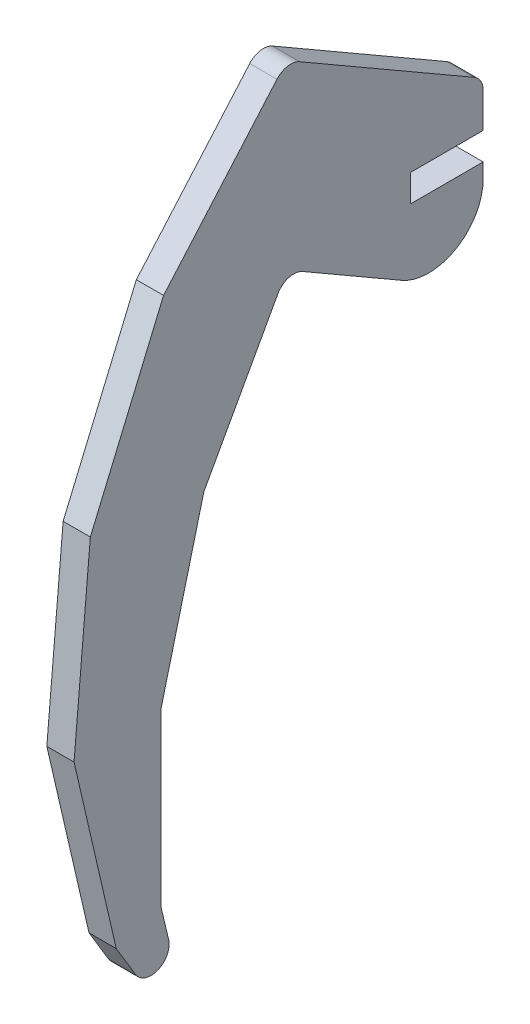
ISO-10303-21;
HEADER;
FILE_DESCRIPTION(('STEP AP214'),'2;1');
FILE_NAME('part.step','',(''),(''),'','','');
FILE_SCHEMA(('AUTOMOTIVE_DESIGN { 1 0 10303 214 1 1 1 1 }'));
ENDSEC;
DATA;
#1=APPLICATION_CONTEXT('core data for automotive mechanical design processes');
#2=APPLICATION_PROTOCOL_DEFINITION('international standard','automotive_design',2000,#1);
#3=PRODUCT_CONTEXT('',#1,'mechanical');
#4=PRODUCT('Part','Part','',(#3));
#5=PRODUCT_RELATED_PRODUCT_CATEGORY('part','',(#4));
#6=PRODUCT_DEFINITION_FORMATION('','',#4);
#7=PRODUCT_DEFINITION_CONTEXT('part definition',#1,'design');
#8=PRODUCT_DEFINITION('design','',#6,#7);
#9=PRODUCT_DEFINITION_SHAPE('','',#8);
#10=(LENGTH_UNIT() NAMED_UNIT(*) SI_UNIT(.MILLI.,.METRE.));
#11=(NAMED_UNIT(*) PLANE_ANGLE_UNIT() SI_UNIT($,.RADIAN.));
#12=(NAMED_UNIT(*) SI_UNIT($,.STERADIAN.) SOLID_ANGLE_UNIT());
#13=UNCERTAINTY_MEASURE_WITH_UNIT(LENGTH_MEASURE(1.E-05),#10,'distance_accuracy_value','');
#14=(GEOMETRIC_REPRESENTATION_CONTEXT(3) GLOBAL_UNCERTAINTY_ASSIGNED_CONTEXT((#13)) GLOBAL_UNIT_ASSIGNED_CONTEXT((#10,
#11,#12)) REPRESENTATION_CONTEXT('',''));
#15=CARTESIAN_POINT('',(0.,0.,0.));
#16=DIRECTION('',(0.,0.,1.));
#17=DIRECTION('',(1.,0.,0.));
#18=AXIS2_PLACEMENT_3D('',#15,#16,#17);
#19=CARTESIAN_POINT('',(3.,2.49999999999475,-21.6506350946111));
#20=DIRECTION('',(0.,1.,0.));
#21=DIRECTION('',(0.,0.,1.));
#22=AXIS2_PLACEMENT_3D('',#19,#20,#21);
#23=PLANE('',#22);
#24=DIRECTION('',(0.,0.,-1.));
#25=VECTOR('',#24,1.);
#26=CARTESIAN_POINT('',(0.,2.49999999999475,-21.6506350946111));
#27=LINE('',#26,#25);
#28=CARTESIAN_POINT('',(0.,2.49999999999475,-13.6506350946111));
#29=VERTEX_POINT('',#28);
#30=CARTESIAN_POINT('',(0.,2.49999999999475,-21.6506350946111));
#31=VERTEX_POINT('',#30);
#32=EDGE_CURVE('E207',#29,#31,#27,.T.);
#33=ORIENTED_EDGE('',*,*,#32,.T.);
#34=DIRECTION('',(-1.,0.,0.));
#35=VECTOR('',#34,1.);
#36=CARTESIAN_POINT('',(3.,2.49999999999475,-21.6506350946111));
#37=LINE('',#36,#35);
#38=CARTESIAN_POINT('',(3.,2.49999999999475,-21.6506350946111));
#39=VERTEX_POINT('',#38);
#40=EDGE_CURVE('E11',#39,#31,#37,.T.);
#41=ORIENTED_EDGE('',*,*,#40,.F.);
#42=DIRECTION('',(0.,0.,-1.));
#43=VECTOR('',#42,1.);
#44=CARTESIAN_POINT('',(3.,2.49999999999475,-21.6506350946111));
#45=LINE('',#44,#43);
#46=CARTESIAN_POINT('',(3.,2.49999999999475,-13.6506350946111));
#47=VERTEX_POINT('',#46);
#48=EDGE_CURVE('E247',#47,#39,#45,.T.);
#49=ORIENTED_EDGE('',*,*,#48,.F.);
#50=DIRECTION('',(-1.,0.,0.));
#51=VECTOR('',#50,1.);
#52=CARTESIAN_POINT('',(3.,2.49999999999475,-13.6506350946111));
#53=LINE('',#52,#51);
#54=EDGE_CURVE('E203',#47,#29,#53,.T.);
#55=ORIENTED_EDGE('',*,*,#54,.T.);
#56=EDGE_LOOP('',(#33,#41,#49,#55));
#57=FACE_BOUND('',#56,.T.);
#58=ADVANCED_FACE('F33',(#57),#23,.F.);
#59=CARTESIAN_POINT('',(3.,6.34529946161551,-21.650635094611));
#60=DIRECTION('',(0.,0.,1.));
#61=DIRECTION('',(0.,-1.,0.));
#62=AXIS2_PLACEMENT_3D('',#59,#60,#61);
#63=PLANE('',#62);
#64=DIRECTION('',(0.,1.,0.));
#65=VECTOR('',#64,1.);
#66=CARTESIAN_POINT('',(0.,6.34529946161551,-21.650635094611));
#67=LINE('',#66,#65);
#68=CARTESIAN_POINT('',(0.,6.34529946161551,-21.650635094611));
#69=VERTEX_POINT('',#68);
#70=EDGE_CURVE('E210',#31,#69,#67,.T.);
#71=ORIENTED_EDGE('',*,*,#70,.T.);
#72=DIRECTION('',(-1.,0.,0.));
#73=VECTOR('',#72,1.);
#74=CARTESIAN_POINT('',(3.,6.34529946161551,-21.650635094611));
#75=LINE('',#74,#73);
#76=CARTESIAN_POINT('',(3.,6.34529946161551,-21.650635094611));
#77=VERTEX_POINT('',#76);
#78=EDGE_CURVE('E41',#77,#69,#75,.T.);
#79=ORIENTED_EDGE('',*,*,#78,.F.);
#80=DIRECTION('',(0.,1.,0.));
#81=VECTOR('',#80,1.);
#82=CARTESIAN_POINT('',(3.,6.34529946161551,-21.650635094611));
#83=LINE('',#82,#81);
#84=EDGE_CURVE('E131',#39,#77,#83,.T.);
#85=ORIENTED_EDGE('',*,*,#84,.F.);
#86=ORIENTED_EDGE('',*,*,#40,.T.);
#87=EDGE_LOOP('',(#71,#79,#85,#86));
#88=FACE_BOUND('',#87,.T.);
#89=ADVANCED_FACE('F370',(#88),#63,.F.);
#90=CARTESIAN_POINT('',(3.,6.34529946161549,-19.650635094611));
#91=DIRECTION('',(-1.,0.,0.));
#92=DIRECTION('',(0.,0.,1.));
#93=AXIS2_PLACEMENT_3D('',#90,#91,#92);
#94=CYLINDRICAL_SURFACE('',#93,2.00000000000001);
#95=CARTESIAN_POINT('',(0.,6.34529946161549,-19.650635094611));
#96=DIRECTION('',(1.,0.,0.));
#97=DIRECTION('',(0.,0.,1.));
#98=AXIS2_PLACEMENT_3D('',#95,#96,#97);
#99=CIRCLE('',#98,2.00000000000001);
#100=CARTESIAN_POINT('',(0.,8.07735026918437,-20.650635094611));
#101=VERTEX_POINT('',#100);
#102=EDGE_CURVE('E212',#69,#101,#99,.T.);
#103=ORIENTED_EDGE('',*,*,#102,.T.);
#104=DIRECTION('',(-1.,0.,0.));
#105=VECTOR('',#104,1.);
#106=CARTESIAN_POINT('',(3.,8.07735026918437,-20.650635094611));
#107=LINE('',#106,#105);
#108=CARTESIAN_POINT('',(3.,8.07735026918437,-20.650635094611));
#109=VERTEX_POINT('',#108);
#110=EDGE_CURVE('E293',#109,#101,#107,.T.);
#111=ORIENTED_EDGE('',*,*,#110,.F.);
#112=CARTESIAN_POINT('',(3.,6.34529946161549,-19.650635094611));
#113=DIRECTION('',(1.,0.,0.));
#114=DIRECTION('',(0.,0.,1.));
#115=AXIS2_PLACEMENT_3D('',#112,#113,#114);
#116=CIRCLE('',#115,2.00000000000001);
#117=EDGE_CURVE('E301',#77,#109,#116,.T.);
#118=ORIENTED_EDGE('',*,*,#117,.F.);
#119=ORIENTED_EDGE('',*,*,#78,.T.);
#120=EDGE_LOOP('',(#103,#111,#118,#119));
#121=FACE_BOUND('',#120,.T.);
#122=ADVANCED_FACE('F299',(#121),#94,.T.);
#123=CARTESIAN_POINT('',(3.,19.175465981255,-1.42813481302609));
#124=DIRECTION('',(0.,-0.86602540378444,0.499999999999998));
#125=DIRECTION('',(0.,-0.499999999999998,-0.86602540378444));
#126=AXIS2_PLACEMENT_3D('',#123,#124,#125);
#127=PLANE('',#126);
#128=DIRECTION('',(0.,0.499999999999998,0.86602540378444));
#129=VECTOR('',#128,1.);
#130=CARTESIAN_POINT('',(0.,19.175465981255,-1.42813481302609));
#131=LINE('',#130,#129);
#132=CARTESIAN_POINT('',(0.,19.175465981255,-1.42813481302609));
#133=VERTEX_POINT('',#132);
#134=EDGE_CURVE('E214',#101,#133,#131,.T.);
#135=ORIENTED_EDGE('',*,*,#134,.T.);
#136=DIRECTION('',(-1.,0.,0.));
#137=VECTOR('',#136,1.);
#138=CARTESIAN_POINT('',(3.,19.175465981255,-1.42813481302609));
#139=LINE('',#138,#137);
#140=CARTESIAN_POINT('',(3.,19.175465981255,-1.42813481302609));
#141=VERTEX_POINT('',#140);
#142=EDGE_CURVE('E290',#141,#133,#139,.T.);
#143=ORIENTED_EDGE('',*,*,#142,.F.);
#144=DIRECTION('',(0.,0.499999999999998,0.86602540378444));
#145=VECTOR('',#144,1.);
#146=CARTESIAN_POINT('',(3.,19.175465981255,-1.42813481302609));
#147=LINE('',#146,#145);
#148=EDGE_CURVE('E319',#109,#141,#147,.T.);
#149=ORIENTED_EDGE('',*,*,#148,.F.);
#150=ORIENTED_EDGE('',*,*,#110,.T.);
#151=EDGE_LOOP('',(#135,#143,#149,#150));
#152=FACE_BOUND('',#151,.T.);
#153=ADVANCED_FACE('F310',(#152),#127,.F.);
#154=CARTESIAN_POINT('',(3.,17.4434151736861,-0.428134813026099));
#155=DIRECTION('',(-1.,0.,0.));
#156=DIRECTION('',(0.,0.,1.));
#157=AXIS2_PLACEMENT_3D('',#154,#155,#156);
#158=CYLINDRICAL_SURFACE('',#157,2.);
#159=CARTESIAN_POINT('',(0.,17.4434151736861,-0.428134813026099));
#160=DIRECTION('',(1.,0.,0.));
#161=DIRECTION('',(0.,0.,-1.));
#162=AXIS2_PLACEMENT_3D('',#159,#160,#161);
#163=CIRCLE('',#162,2.);
#164=CARTESIAN_POINT('',(0.,18.7551779984705,1.08159307355275));
#165=VERTEX_POINT('',#164);
#166=EDGE_CURVE('E216',#133,#165,#163,.T.);
#167=ORIENTED_EDGE('',*,*,#166,.T.);
#168=DIRECTION('',(-1.,0.,0.));
#169=VECTOR('',#168,1.);
#170=CARTESIAN_POINT('',(3.,18.7551779984705,1.08159307355275));
#171=LINE('',#170,#169);
#172=CARTESIAN_POINT('',(3.,18.7551779984705,1.08159307355275));
#173=VERTEX_POINT('',#172);
#174=EDGE_CURVE('E287',#173,#165,#171,.T.);
#175=ORIENTED_EDGE('',*,*,#174,.F.);
#176=CARTESIAN_POINT('',(3.,17.4434151736861,-0.428134813026099));
#177=DIRECTION('',(1.,0.,0.));
#178=DIRECTION('',(0.,0.,-1.));
#179=AXIS2_PLACEMENT_3D('',#176,#177,#178);
#180=CIRCLE('',#179,2.);
#181=EDGE_CURVE('E316',#141,#173,#180,.T.);
#182=ORIENTED_EDGE('',*,*,#181,.F.);
#183=ORIENTED_EDGE('',*,*,#142,.T.);
#184=EDGE_LOOP('',(#167,#175,#182,#183));
#185=FACE_BOUND('',#184,.T.);
#186=ADVANCED_FACE('F314',(#185),#158,.T.);
#187=CARTESIAN_POINT('',(3.,18.7551779984705,1.08159307355275));
#188=DIRECTION('',(0.,-0.655881412392163,-0.754863943289425));
#189=DIRECTION('',(0.,0.754863943289426,-0.655881412392163));
#190=AXIS2_PLACEMENT_3D('',#187,#188,#189);
#191=PLANE('',#190);
#192=DIRECTION('',(0.,-0.754863943289425,0.655881412392163));
#193=VECTOR('',#192,1.);
#194=CARTESIAN_POINT('',(0.,18.7551779984705,1.08159307355275));
#195=LINE('',#194,#193);
#196=CARTESIAN_POINT('',(0.,4.37047332924356,13.5800843568744));
#197=VERTEX_POINT('',#196);
#198=EDGE_CURVE('E218',#165,#197,#195,.T.);
#199=ORIENTED_EDGE('',*,*,#198,.T.);
#200=DIRECTION('',(-1.,0.,0.));
#201=VECTOR('',#200,1.);
#202=CARTESIAN_POINT('',(3.,4.37047332924356,13.5800843568744));
#203=LINE('',#202,#201);
#204=CARTESIAN_POINT('',(3.,4.37047332924356,13.5800843568744));
#205=VERTEX_POINT('',#204);
#206=EDGE_CURVE('E284',#205,#197,#203,.T.);
#207=ORIENTED_EDGE('',*,*,#206,.F.);
#208=DIRECTION('',(0.,-0.754863943289425,0.655881412392163));
#209=VECTOR('',#208,1.);
#210=CARTESIAN_POINT('',(3.,18.7551779984705,1.08159307355275));
#211=LINE('',#210,#209);
#212=EDGE_CURVE('E318',#173,#205,#211,.T.);
#213=ORIENTED_EDGE('',*,*,#212,.F.);
#214=ORIENTED_EDGE('',*,*,#174,.T.);
#215=EDGE_LOOP('',(#199,#207,#213,#214));
#216=FACE_BOUND('',#215,.T.);
#217=ADVANCED_FACE('F383',(#216),#191,.F.);
#218=CARTESIAN_POINT('',(3.,4.37047332924356,13.5800843568744));
#219=DIRECTION('',(0.,-0.390514504255119,-0.920596774905484));
#220=DIRECTION('',(0.,0.920596774905484,-0.390514504255119));
#221=AXIS2_PLACEMENT_3D('',#218,#219,#220);
#222=PLANE('',#221);
#223=DIRECTION('',(0.,-0.920596774905484,0.390514504255119));
#224=VECTOR('',#223,1.);
#225=CARTESIAN_POINT('',(0.,4.37047332924356,13.5800843568744));
#226=LINE('',#225,#224);
#227=CARTESIAN_POINT('',(0.,-14.6534289365135,21.6499689847808));
#228=VERTEX_POINT('',#227);
#229=EDGE_CURVE('E220',#197,#228,#226,.T.);
#230=ORIENTED_EDGE('',*,*,#229,.T.);
#231=DIRECTION('',(-1.,0.,0.));
#232=VECTOR('',#231,1.);
#233=CARTESIAN_POINT('',(3.,-14.6534289365135,21.6499689847808));
#234=LINE('',#233,#232);
#235=CARTESIAN_POINT('',(3.,-14.6534289365135,21.6499689847808));
#236=VERTEX_POINT('',#235);
#237=EDGE_CURVE('E281',#236,#228,#234,.T.);
#238=ORIENTED_EDGE('',*,*,#237,.F.);
#239=DIRECTION('',(0.,-0.920596774905484,0.390514504255119));
#240=VECTOR('',#239,1.);
#241=CARTESIAN_POINT('',(3.,4.37047332924356,13.5800843568744));
#242=LINE('',#241,#240);
#243=EDGE_CURVE('E321',#205,#236,#242,.T.);
#244=ORIENTED_EDGE('',*,*,#243,.F.);
#245=ORIENTED_EDGE('',*,*,#206,.T.);
#246=EDGE_LOOP('',(#230,#238,#244,#245));
#247=FACE_BOUND('',#246,.T.);
#248=ADVANCED_FACE('F386',(#247),#222,.F.);
#249=CARTESIAN_POINT('',(3.,-14.6534289365135,21.6499689847808));
#250=DIRECTION('',(0.,-0.0869213155670386,-0.996215180018903));
#251=DIRECTION('',(0.,0.996215180018903,-0.0869213155670386));
#252=AXIS2_PLACEMENT_3D('',#249,#250,#251);
#253=PLANE('',#252);
#254=DIRECTION('',(0.,-0.996215180018903,0.0869213155670386));
#255=VECTOR('',#254,1.);
#256=CARTESIAN_POINT('',(0.,-14.6534289365135,21.6499689847808));
#257=LINE('',#256,#255);
#258=CARTESIAN_POINT('',(0.,-35.239966644392,23.4461762464542));
#259=VERTEX_POINT('',#258);
#260=EDGE_CURVE('E222',#228,#259,#257,.T.);
#261=ORIENTED_EDGE('',*,*,#260,.T.);
#262=DIRECTION('',(-1.,0.,0.));
#263=VECTOR('',#262,1.);
#264=CARTESIAN_POINT('',(3.,-35.239966644392,23.4461762464542));
#265=LINE('',#264,#263);
#266=CARTESIAN_POINT('',(3.,-35.239966644392,23.4461762464542));
#267=VERTEX_POINT('',#266);
#268=EDGE_CURVE('E278',#267,#259,#265,.T.);
#269=ORIENTED_EDGE('',*,*,#268,.F.);
#270=DIRECTION('',(0.,-0.996215180018903,0.0869213155670386));
#271=VECTOR('',#270,1.);
#272=CARTESIAN_POINT('',(3.,-14.6534289365135,21.6499689847808));
#273=LINE('',#272,#271);
#274=EDGE_CURVE('E327',#236,#267,#273,.T.);
#275=ORIENTED_EDGE('',*,*,#274,.F.);
#276=ORIENTED_EDGE('',*,*,#237,.T.);
#277=EDGE_LOOP('',(#261,#269,#275,#276));
#278=FACE_BOUND('',#277,.T.);
#279=ADVANCED_FACE('F390',(#278),#253,.F.);
#280=CARTESIAN_POINT('',(3.,-35.239966644392,23.4461762464542));
#281=DIRECTION('',(0.,0.225180337105159,-0.97431710227277));
#282=DIRECTION('',(0.,0.97431710227277,0.225180337105159));
#283=AXIS2_PLACEMENT_3D('',#280,#281,#282);
#284=PLANE('',#283);
#285=DIRECTION('',(0.,-0.97431710227277,-0.225180337105159));
#286=VECTOR('',#285,1.);
#287=CARTESIAN_POINT('',(0.,-35.239966644392,23.4461762464542));
#288=LINE('',#287,#286);
#289=CARTESIAN_POINT('',(0.,-55.3739860487026,18.7928808602102));
#290=VERTEX_POINT('',#289);
#291=EDGE_CURVE('E224',#259,#290,#288,.T.);
#292=ORIENTED_EDGE('',*,*,#291,.T.);
#293=DIRECTION('',(-1.,0.,0.));
#294=VECTOR('',#293,1.);
#295=CARTESIAN_POINT('',(3.,-55.3739860487026,18.7928808602102));
#296=LINE('',#295,#294);
#297=CARTESIAN_POINT('',(3.,-55.3739860487026,18.7928808602102));
#298=VERTEX_POINT('',#297);
#299=EDGE_CURVE('E275',#298,#290,#296,.T.);
#300=ORIENTED_EDGE('',*,*,#299,.F.);
#301=DIRECTION('',(0.,-0.97431710227277,-0.225180337105159));
#302=VECTOR('',#301,1.);
#303=CARTESIAN_POINT('',(3.,-35.239966644392,23.4461762464542));
#304=LINE('',#303,#302);
#305=EDGE_CURVE('E329',#267,#298,#304,.T.);
#306=ORIENTED_EDGE('',*,*,#305,.F.);
#307=ORIENTED_EDGE('',*,*,#268,.T.);
#308=EDGE_LOOP('',(#292,#300,#306,#307));
#309=FACE_BOUND('',#308,.T.);
#310=ADVANCED_FACE('F394',(#309),#284,.F.);
#311=CARTESIAN_POINT('',(3.,-55.3739860487026,18.7928808602102));
#312=DIRECTION('',(0.,0.515239769457841,-0.857046078089755));
#313=DIRECTION('',(0.,0.857046078089755,0.515239769457841));
#314=AXIS2_PLACEMENT_3D('',#311,#312,#313);
#315=PLANE('',#314);
#316=DIRECTION('',(0.,-0.857046078089755,-0.515239769457841));
#317=VECTOR('',#316,1.);
#318=CARTESIAN_POINT('',(0.,-55.3739860487026,18.7928808602102));
#319=LINE('',#318,#317);
#320=CARTESIAN_POINT('',(0.,-58.8914677061583,16.6782379202423));
#321=VERTEX_POINT('',#320);
#322=EDGE_CURVE('E226',#290,#321,#319,.T.);
#323=ORIENTED_EDGE('',*,*,#322,.T.);
#324=DIRECTION('',(-1.,0.,0.));
#325=VECTOR('',#324,1.);
#326=CARTESIAN_POINT('',(3.,-58.8914677061583,16.6782379202423));
#327=LINE('',#326,#325);
#328=CARTESIAN_POINT('',(3.,-58.8914677061583,16.6782379202423));
#329=VERTEX_POINT('',#328);
#330=EDGE_CURVE('E272',#329,#321,#327,.T.);
#331=ORIENTED_EDGE('',*,*,#330,.F.);
#332=DIRECTION('',(0.,-0.857046078089755,-0.515239769457841));
#333=VECTOR('',#332,1.);
#334=CARTESIAN_POINT('',(3.,-55.3739860487026,18.7928808602102));
#335=LINE('',#334,#333);
#336=EDGE_CURVE('E331',#298,#329,#335,.T.);
#337=ORIENTED_EDGE('',*,*,#336,.F.);
#338=ORIENTED_EDGE('',*,*,#299,.T.);
#339=EDGE_LOOP('',(#323,#331,#337,#338));
#340=FACE_BOUND('',#339,.T.);
#341=ADVANCED_FACE('F398',(#340),#315,.F.);
#342=CARTESIAN_POINT('',(3.,-57.8609881672429,14.9641457640626));
#343=DIRECTION('',(-1.,0.,0.));
#344=DIRECTION('',(0.,0.,1.));
#345=AXIS2_PLACEMENT_3D('',#342,#343,#344);
#346=CYLINDRICAL_SURFACE('',#345,2.);
#347=CARTESIAN_POINT('',(0.,-57.8609881672429,14.9641457640626));
#348=DIRECTION('',(1.,0.,0.));
#349=DIRECTION('',(0.,0.,1.));
#350=AXIS2_PLACEMENT_3D('',#347,#348,#349);
#351=CIRCLE('',#350,2.);
#352=CARTESIAN_POINT('',(0.,-57.3951192414375,13.0191608942066));
#353=VERTEX_POINT('',#352);
#354=EDGE_CURVE('E228',#321,#353,#351,.T.);
#355=ORIENTED_EDGE('',*,*,#354,.T.);
#356=DIRECTION('',(-1.,0.,0.));
#357=VECTOR('',#356,1.);
#358=CARTESIAN_POINT('',(3.,-57.3951192414375,13.0191608942066));
#359=LINE('',#358,#357);
#360=CARTESIAN_POINT('',(3.,-57.3951192414375,13.0191608942066));
#361=VERTEX_POINT('',#360);
#362=EDGE_CURVE('E269',#361,#353,#359,.T.);
#363=ORIENTED_EDGE('',*,*,#362,.F.);
#364=CARTESIAN_POINT('',(3.,-57.8609881672429,14.9641457640626));
#365=DIRECTION('',(1.,0.,0.));
#366=DIRECTION('',(0.,0.,1.));
#367=AXIS2_PLACEMENT_3D('',#364,#365,#366);
#368=CIRCLE('',#367,2.);
#369=EDGE_CURVE('E333',#329,#361,#368,.T.);
#370=ORIENTED_EDGE('',*,*,#369,.F.);
#371=ORIENTED_EDGE('',*,*,#330,.T.);
#372=EDGE_LOOP('',(#355,#363,#370,#371));
#373=FACE_BOUND('',#372,.T.);
#374=ADVANCED_FACE('F402',(#373),#346,.T.);
#375=CARTESIAN_POINT('',(3.,-53.8468848788973,13.8690452077559));
#376=DIRECTION('',(0.,-0.232934462902559,0.972492434928055));
#377=DIRECTION('',(0.,-0.972492434928055,-0.232934462902559));
#378=AXIS2_PLACEMENT_3D('',#375,#376,#377);
#379=PLANE('',#378);
#380=DIRECTION('',(0.,0.972492434928055,0.232934462902559));
#381=VECTOR('',#380,1.);
#382=CARTESIAN_POINT('',(0.,-53.8468848788973,13.8690452077559));
#383=LINE('',#382,#381);
#384=CARTESIAN_POINT('',(0.,-53.8468848788973,13.8690452077559));
#385=VERTEX_POINT('',#384);
#386=EDGE_CURVE('E230',#353,#385,#383,.T.);
#387=ORIENTED_EDGE('',*,*,#386,.T.);
#388=DIRECTION('',(-1.,0.,0.));
#389=VECTOR('',#388,1.);
#390=CARTESIAN_POINT('',(3.,-53.8468848788973,13.8690452077559));
#391=LINE('',#390,#389);
#392=CARTESIAN_POINT('',(3.,-53.8468848788973,13.8690452077559));
#393=VERTEX_POINT('',#392);
#394=EDGE_CURVE('E266',#393,#385,#391,.T.);
#395=ORIENTED_EDGE('',*,*,#394,.F.);
#396=DIRECTION('',(0.,0.972492434928055,0.232934462902559));
#397=VECTOR('',#396,1.);
#398=CARTESIAN_POINT('',(3.,-53.8468848788973,13.8690452077559));
#399=LINE('',#398,#397);
#400=EDGE_CURVE('E335',#361,#393,#399,.T.);
#401=ORIENTED_EDGE('',*,*,#400,.F.);
#402=ORIENTED_EDGE('',*,*,#362,.T.);
#403=EDGE_LOOP('',(#387,#395,#401,#402));
#404=FACE_BOUND('',#403,.T.);
#405=ADVANCED_FACE('F406',(#404),#379,.F.);
#406=CARTESIAN_POINT('',(3.,-34.9156187672801,13.8546953481199));
#407=DIRECTION('',(0.,0.000757997665291717,0.999999712719729));
#408=DIRECTION('',(0.,-0.999999712719729,0.000757997665291717));
#409=AXIS2_PLACEMENT_3D('',#406,#407,#408);
#410=PLANE('',#409);
#411=DIRECTION('',(0.,0.999999712719728,-0.000757997665291717));
#412=VECTOR('',#411,1.);
#413=CARTESIAN_POINT('',(0.,-34.9156187672801,13.8546953481199));
#414=LINE('',#413,#412);
#415=CARTESIAN_POINT('',(0.,-34.9156187672801,13.8546953481199));
#416=VERTEX_POINT('',#415);
#417=EDGE_CURVE('E232',#385,#416,#414,.T.);
#418=ORIENTED_EDGE('',*,*,#417,.T.);
#419=DIRECTION('',(-1.,0.,0.));
#420=VECTOR('',#419,1.);
#421=CARTESIAN_POINT('',(3.,-34.9156187672801,13.8546953481199));
#422=LINE('',#421,#420);
#423=CARTESIAN_POINT('',(3.,-34.9156187672801,13.8546953481199));
#424=VERTEX_POINT('',#423);
#425=EDGE_CURVE('E263',#424,#416,#422,.T.);
#426=ORIENTED_EDGE('',*,*,#425,.F.);
#427=DIRECTION('',(0.,0.999999712719728,-0.000757997665291717));
#428=VECTOR('',#427,1.);
#429=CARTESIAN_POINT('',(3.,-34.9156187672801,13.8546953481199));
#430=LINE('',#429,#428);
#431=EDGE_CURVE('E337',#393,#424,#430,.T.);
#432=ORIENTED_EDGE('',*,*,#431,.F.);
#433=ORIENTED_EDGE('',*,*,#394,.T.);
#434=EDGE_LOOP('',(#418,#426,#432,#433));
#435=FACE_BOUND('',#434,.T.);
#436=ADVANCED_FACE('F410',(#435),#410,.F.);
#437=CARTESIAN_POINT('',(3.,-16.582681857696,9.13278188252581));
#438=DIRECTION('',(0.,0.249423999495933,0.968394376519945));
#439=DIRECTION('',(0.,-0.968394376519945,0.249423999495933));
#440=AXIS2_PLACEMENT_3D('',#437,#438,#439);
#441=PLANE('',#440);
#442=DIRECTION('',(0.,0.968394376519945,-0.249423999495933));
#443=VECTOR('',#442,1.);
#444=CARTESIAN_POINT('',(0.,-16.582681857696,9.13278188252581));
#445=LINE('',#444,#443);
#446=CARTESIAN_POINT('',(0.,-16.582681857696,9.13278188252581));
#447=VERTEX_POINT('',#446);
#448=EDGE_CURVE('E234',#416,#447,#445,.T.);
#449=ORIENTED_EDGE('',*,*,#448,.T.);
#450=DIRECTION('',(-1.,0.,0.));
#451=VECTOR('',#450,1.);
#452=CARTESIAN_POINT('',(3.,-16.582681857696,9.13278188252581));
#453=LINE('',#452,#451);
#454=CARTESIAN_POINT('',(3.,-16.582681857696,9.13278188252581));
#455=VERTEX_POINT('',#454);
#456=EDGE_CURVE('E260',#455,#447,#453,.T.);
#457=ORIENTED_EDGE('',*,*,#456,.F.);
#458=DIRECTION('',(0.,0.968394376519945,-0.249423999495933));
#459=VECTOR('',#458,1.);
#460=CARTESIAN_POINT('',(3.,-16.582681857696,9.13278188252581));
#461=LINE('',#460,#459);
#462=EDGE_CURVE('E339',#424,#455,#461,.T.);
#463=ORIENTED_EDGE('',*,*,#462,.F.);
#464=ORIENTED_EDGE('',*,*,#425,.T.);
#465=EDGE_LOOP('',(#449,#457,#463,#464));
#466=FACE_BOUND('',#465,.T.);
#467=ADVANCED_FACE('F414',(#466),#441,.F.);
#468=CARTESIAN_POINT('',(3.,-1.78760772575287,0.984510924765902));
#469=DIRECTION('',(0.,0.482417774120942,0.875941260138028));
#470=DIRECTION('',(0.,-0.875941260138028,0.482417774120942));
#471=AXIS2_PLACEMENT_3D('',#468,#469,#470);
#472=PLANE('',#471);
#473=DIRECTION('',(0.,0.875941260138028,-0.482417774120942));
#474=VECTOR('',#473,1.);
#475=CARTESIAN_POINT('',(0.,-1.78760772575287,0.984510924765902));
#476=LINE('',#475,#474);
#477=CARTESIAN_POINT('',(0.,-1.78760772575287,0.984510924765902));
#478=VERTEX_POINT('',#477);
#479=EDGE_CURVE('E236',#447,#478,#476,.T.);
#480=ORIENTED_EDGE('',*,*,#479,.T.);
#481=DIRECTION('',(-1.,0.,0.));
#482=VECTOR('',#481,1.);
#483=CARTESIAN_POINT('',(3.,-1.78760772575287,0.984510924765902));
#484=LINE('',#483,#482);
#485=CARTESIAN_POINT('',(3.,-1.78760772575287,0.984510924765902));
#486=VERTEX_POINT('',#485);
#487=EDGE_CURVE('E257',#486,#478,#484,.T.);
#488=ORIENTED_EDGE('',*,*,#487,.F.);
#489=DIRECTION('',(0.,0.875941260138028,-0.482417774120942));
#490=VECTOR('',#489,1.);
#491=CARTESIAN_POINT('',(3.,-1.78760772575287,0.984510924765902));
#492=LINE('',#491,#490);
#493=EDGE_CURVE('E341',#455,#486,#492,.T.);
#494=ORIENTED_EDGE('',*,*,#493,.F.);
#495=ORIENTED_EDGE('',*,*,#456,.T.);
#496=EDGE_LOOP('',(#480,#488,#494,#495));
#497=FACE_BOUND('',#496,.T.);
#498=ADVANCED_FACE('F418',(#497),#472,.F.);
#499=CARTESIAN_POINT('',(3.,-2.75244327399476,-0.767371595510153));
#500=DIRECTION('',(-1.,0.,0.));
#501=DIRECTION('',(0.,0.,1.));
#502=AXIS2_PLACEMENT_3D('',#499,#500,#501);
#503=CYLINDRICAL_SURFACE('',#502,2.);
#504=CARTESIAN_POINT('',(0.,-2.75244327399476,-0.767371595510153));
#505=DIRECTION('',(-1.,0.,0.));
#506=DIRECTION('',(0.,0.,1.));
#507=AXIS2_PLACEMENT_3D('',#504,#505,#506);
#508=CIRCLE('',#507,2.);
#509=CARTESIAN_POINT('',(0.,-1.02039246642587,-1.76737159551015));
#510=VERTEX_POINT('',#509);
#511=EDGE_CURVE('E238',#478,#510,#508,.T.);
#512=ORIENTED_EDGE('',*,*,#511,.T.);
#513=DIRECTION('',(-1.,0.,0.));
#514=VECTOR('',#513,1.);
#515=CARTESIAN_POINT('',(3.,-1.02039246642587,-1.76737159551015));
#516=LINE('',#515,#514);
#517=CARTESIAN_POINT('',(3.,-1.02039246642587,-1.76737159551015));
#518=VERTEX_POINT('',#517);
#519=EDGE_CURVE('E254',#518,#510,#516,.T.);
#520=ORIENTED_EDGE('',*,*,#519,.F.);
#521=CARTESIAN_POINT('',(3.,-2.75244327399476,-0.767371595510153));
#522=DIRECTION('',(-1.,0.,0.));
#523=DIRECTION('',(0.,0.,1.));
#524=AXIS2_PLACEMENT_3D('',#521,#522,#523);
#525=CIRCLE('',#524,2.);
#526=EDGE_CURVE('E343',#486,#518,#525,.T.);
#527=ORIENTED_EDGE('',*,*,#526,.F.);
#528=ORIENTED_EDGE('',*,*,#487,.T.);
#529=EDGE_LOOP('',(#512,#520,#527,#528));
#530=FACE_BOUND('',#529,.T.);
#531=ADVANCED_FACE('F422',(#530),#503,.F.);
#532=CARTESIAN_POINT('',(3.,-7.30384757729337,-12.650635094611));
#533=DIRECTION('',(0.,0.86602540378444,-0.499999999999998));
#534=DIRECTION('',(0.,0.499999999999998,0.86602540378444));
#535=AXIS2_PLACEMENT_3D('',#532,#533,#534);
#536=PLANE('',#535);
#537=DIRECTION('',(0.,-0.499999999999998,-0.86602540378444));
#538=VECTOR('',#537,1.);
#539=CARTESIAN_POINT('',(0.,-7.30384757729337,-12.650635094611));
#540=LINE('',#539,#538);
#541=CARTESIAN_POINT('',(0.,-7.30384757729337,-12.650635094611));
#542=VERTEX_POINT('',#541);
#543=EDGE_CURVE('E240',#510,#542,#540,.T.);
#544=ORIENTED_EDGE('',*,*,#543,.T.);
#545=DIRECTION('',(-1.,0.,0.));
#546=VECTOR('',#545,1.);
#547=CARTESIAN_POINT('',(3.,-7.30384757729337,-12.650635094611));
#548=LINE('',#547,#546);
#549=CARTESIAN_POINT('',(3.,-7.30384757729337,-12.650635094611));
#550=VERTEX_POINT('',#549);
#551=EDGE_CURVE('E251',#550,#542,#548,.T.);
#552=ORIENTED_EDGE('',*,*,#551,.F.);
#553=DIRECTION('',(0.,-0.499999999999998,-0.86602540378444));
#554=VECTOR('',#553,1.);
#555=CARTESIAN_POINT('',(3.,-7.30384757729337,-12.650635094611));
#556=LINE('',#555,#554);
#557=EDGE_CURVE('E345',#518,#550,#556,.T.);
#558=ORIENTED_EDGE('',*,*,#557,.F.);
#559=ORIENTED_EDGE('',*,*,#519,.T.);
#560=EDGE_LOOP('',(#544,#552,#558,#559));
#561=FACE_BOUND('',#560,.T.);
#562=ADVANCED_FACE('F351',(#561),#536,.F.);
#563=CARTESIAN_POINT('',(3.,-2.10769515458677,-15.6506350946111));
#564=DIRECTION('',(-1.,0.,0.));
#565=DIRECTION('',(0.,0.,1.));
#566=AXIS2_PLACEMENT_3D('',#563,#564,#565);
#567=CYLINDRICAL_SURFACE('',#566,6.);
#568=CARTESIAN_POINT('',(0.,-2.10769515458677,-15.6506350946111));
#569=DIRECTION('',(1.,0.,0.));
#570=DIRECTION('',(0.,0.,1.));
#571=AXIS2_PLACEMENT_3D('',#568,#569,#570);
#572=CIRCLE('',#571,6.);
#573=CARTESIAN_POINT('',(0.,-2.10769515458662,-21.6506350946111));
#574=VERTEX_POINT('',#573);
#575=EDGE_CURVE('E242',#542,#574,#572,.T.);
#576=ORIENTED_EDGE('',*,*,#575,.T.);
#577=DIRECTION('',(-1.,0.,0.));
#578=VECTOR('',#577,1.);
#579=CARTESIAN_POINT('',(3.,-2.10769515458662,-21.6506350946111));
#580=LINE('',#579,#578);
#581=CARTESIAN_POINT('',(3.,-2.10769515458662,-21.6506350946111));
#582=VERTEX_POINT('',#581);
#583=EDGE_CURVE('E198',#582,#574,#580,.T.);
#584=ORIENTED_EDGE('',*,*,#583,.F.);
#585=CARTESIAN_POINT('',(3.,-2.10769515458677,-15.6506350946111));
#586=DIRECTION('',(1.,0.,0.));
#587=DIRECTION('',(0.,0.,1.));
#588=AXIS2_PLACEMENT_3D('',#585,#586,#587);
#589=CIRCLE('',#588,6.);
#590=EDGE_CURVE('E189',#550,#582,#589,.T.);
#591=ORIENTED_EDGE('',*,*,#590,.F.);
#592=ORIENTED_EDGE('',*,*,#551,.T.);
#593=EDGE_LOOP('',(#576,#584,#591,#592));
#594=FACE_BOUND('',#593,.T.);
#595=ADVANCED_FACE('F355',(#594),#567,.T.);
#596=CARTESIAN_POINT('',(3.,-0.500000000005246,-21.6506350946111));
#597=DIRECTION('',(0.,0.,1.));
#598=DIRECTION('',(0.,-1.,0.));
#599=AXIS2_PLACEMENT_3D('',#596,#597,#598);
#600=PLANE('',#599);
#601=DIRECTION('',(0.,1.,0.));
#602=VECTOR('',#601,1.);
#603=CARTESIAN_POINT('',(0.,-0.500000000005246,-21.6506350946111));
#604=LINE('',#603,#602);
#605=CARTESIAN_POINT('',(0.,-0.500000000005246,-21.6506350946111));
#606=VERTEX_POINT('',#605);
#607=EDGE_CURVE('E197',#574,#606,#604,.T.);
#608=ORIENTED_EDGE('',*,*,#607,.T.);
#609=DIRECTION('',(-1.,0.,0.));
#610=VECTOR('',#609,1.);
#611=CARTESIAN_POINT('',(3.,-0.500000000005246,-21.6506350946111));
#612=LINE('',#611,#610);
#613=CARTESIAN_POINT('',(3.,-0.500000000005246,-21.6506350946111));
#614=VERTEX_POINT('',#613);
#615=EDGE_CURVE('E194',#614,#606,#612,.T.);
#616=ORIENTED_EDGE('',*,*,#615,.F.);
#617=DIRECTION('',(0.,1.,0.));
#618=VECTOR('',#617,1.);
#619=CARTESIAN_POINT('',(3.,-0.500000000005246,-21.6506350946111));
#620=LINE('',#619,#618);
#621=EDGE_CURVE('E183',#582,#614,#620,.T.);
#622=ORIENTED_EDGE('',*,*,#621,.F.);
#623=ORIENTED_EDGE('',*,*,#583,.T.);
#624=EDGE_LOOP('',(#608,#616,#622,#623));
#625=FACE_BOUND('',#624,.T.);
#626=ADVANCED_FACE('F195',(#625),#600,.F.);
#627=CARTESIAN_POINT('',(3.,-0.500000000005246,-21.6506350946111));
#628=DIRECTION('',(0.,-1.,0.));
#629=DIRECTION('',(0.,0.,-1.));
#630=AXIS2_PLACEMENT_3D('',#627,#628,#629);
#631=PLANE('',#630);
#632=DIRECTION('',(0.,0.,1.));
#633=VECTOR('',#632,1.);
#634=CARTESIAN_POINT('',(0.,-0.500000000005246,-21.6506350946111));
#635=LINE('',#634,#633);
#636=CARTESIAN_POINT('',(0.,-0.500000000005247,-13.6506350946111));
#637=VERTEX_POINT('',#636);
#638=EDGE_CURVE('E117',#606,#637,#635,.T.);
#639=ORIENTED_EDGE('',*,*,#638,.T.);
#640=DIRECTION('',(-1.,0.,0.));
#641=VECTOR('',#640,1.);
#642=CARTESIAN_POINT('',(3.,-0.500000000005247,-13.6506350946111));
#643=LINE('',#642,#641);
#644=CARTESIAN_POINT('',(3.,-0.500000000005247,-13.6506350946111));
#645=VERTEX_POINT('',#644);
#646=EDGE_CURVE('E199',#645,#637,#643,.T.);
#647=ORIENTED_EDGE('',*,*,#646,.F.);
#648=DIRECTION('',(0.,0.,1.));
#649=VECTOR('',#648,1.);
#650=CARTESIAN_POINT('',(3.,-0.500000000005246,-21.6506350946111));
#651=LINE('',#650,#649);
#652=EDGE_CURVE('E187',#614,#645,#651,.T.);
#653=ORIENTED_EDGE('',*,*,#652,.F.);
#654=ORIENTED_EDGE('',*,*,#615,.T.);
#655=EDGE_LOOP('',(#639,#647,#653,#654));
#656=FACE_BOUND('',#655,.T.);
#657=ADVANCED_FACE('F201',(#656),#631,.F.);
#658=CARTESIAN_POINT('',(3.,2.49999999999475,-13.6506350946111));
#659=DIRECTION('',(0.,0.,1.));
#660=DIRECTION('',(0.,-1.,0.));
#661=AXIS2_PLACEMENT_3D('',#658,#659,#660);
#662=PLANE('',#661);
#663=DIRECTION('',(0.,1.,0.));
#664=VECTOR('',#663,1.);
#665=CARTESIAN_POINT('',(0.,2.49999999999475,-13.6506350946111));
#666=LINE('',#665,#664);
#667=EDGE_CURVE('E123',#637,#29,#666,.T.);
#668=ORIENTED_EDGE('',*,*,#667,.T.);
#669=ORIENTED_EDGE('',*,*,#54,.F.);
#670=DIRECTION('',(0.,1.,0.));
#671=VECTOR('',#670,1.);
#672=CARTESIAN_POINT('',(3.,2.49999999999475,-13.6506350946111));
#673=LINE('',#672,#671);
#674=EDGE_CURVE('E49',#645,#47,#673,.T.);
#675=ORIENTED_EDGE('',*,*,#674,.F.);
#676=ORIENTED_EDGE('',*,*,#646,.T.);
#677=EDGE_LOOP('',(#668,#669,#675,#676));
#678=FACE_BOUND('',#677,.T.);
#679=ADVANCED_FACE('F359',(#678),#662,.F.);
#680=CARTESIAN_POINT('',(3.,-2.10769515458677,-15.6506350946111));
#681=DIRECTION('',(-1.,0.,0.));
#682=DIRECTION('',(0.,0.,1.));
#683=AXIS2_PLACEMENT_3D('',#680,#681,#682);
#684=PLANE('',#683);
#685=ORIENTED_EDGE('',*,*,#48,.T.);
#686=ORIENTED_EDGE('',*,*,#84,.T.);
#687=ORIENTED_EDGE('',*,*,#117,.T.);
#688=ORIENTED_EDGE('',*,*,#148,.T.);
#689=ORIENTED_EDGE('',*,*,#181,.T.);
#690=ORIENTED_EDGE('',*,*,#212,.T.);
#691=ORIENTED_EDGE('',*,*,#243,.T.);
#692=ORIENTED_EDGE('',*,*,#274,.T.);
#693=ORIENTED_EDGE('',*,*,#305,.T.);
#694=ORIENTED_EDGE('',*,*,#336,.T.);
#695=ORIENTED_EDGE('',*,*,#369,.T.);
#696=ORIENTED_EDGE('',*,*,#400,.T.);
#697=ORIENTED_EDGE('',*,*,#431,.T.);
#698=ORIENTED_EDGE('',*,*,#462,.T.);
#699=ORIENTED_EDGE('',*,*,#493,.T.);
#700=ORIENTED_EDGE('',*,*,#526,.T.);
#701=ORIENTED_EDGE('',*,*,#557,.T.);
#702=ORIENTED_EDGE('',*,*,#590,.T.);
#703=ORIENTED_EDGE('',*,*,#621,.T.);
#704=ORIENTED_EDGE('',*,*,#652,.T.);
#705=ORIENTED_EDGE('',*,*,#674,.T.);
#706=EDGE_LOOP('',(#685,#686,#687,#688,#689,#690,#691,#692,#693,#694,#695,#696,#697,#698,#699,
#700,#701,#702,#703,#704,#705));
#707=FACE_BOUND('',#706,.T.);
#708=ADVANCED_FACE('F185',(#707),#684,.F.);
#709=CARTESIAN_POINT('',(0.,-2.10769515458677,-15.6506350946111));
#710=DIRECTION('',(-1.,0.,0.));
#711=DIRECTION('',(0.,0.,1.));
#712=AXIS2_PLACEMENT_3D('',#709,#710,#711);
#713=PLANE('',#712);
#714=ORIENTED_EDGE('',*,*,#32,.F.);
#715=ORIENTED_EDGE('',*,*,#667,.F.);
#716=ORIENTED_EDGE('',*,*,#638,.F.);
#717=ORIENTED_EDGE('',*,*,#607,.F.);
#718=ORIENTED_EDGE('',*,*,#575,.F.);
#719=ORIENTED_EDGE('',*,*,#543,.F.);
#720=ORIENTED_EDGE('',*,*,#511,.F.);
#721=ORIENTED_EDGE('',*,*,#479,.F.);
#722=ORIENTED_EDGE('',*,*,#448,.F.);
#723=ORIENTED_EDGE('',*,*,#417,.F.);
#724=ORIENTED_EDGE('',*,*,#386,.F.);
#725=ORIENTED_EDGE('',*,*,#354,.F.);
#726=ORIENTED_EDGE('',*,*,#322,.F.);
#727=ORIENTED_EDGE('',*,*,#291,.F.);
#728=ORIENTED_EDGE('',*,*,#260,.F.);
#729=ORIENTED_EDGE('',*,*,#229,.F.);
#730=ORIENTED_EDGE('',*,*,#198,.F.);
#731=ORIENTED_EDGE('',*,*,#166,.F.);
#732=ORIENTED_EDGE('',*,*,#134,.F.);
#733=ORIENTED_EDGE('',*,*,#102,.F.);
#734=ORIENTED_EDGE('',*,*,#70,.F.);
#735=EDGE_LOOP('',(#714,#715,#716,#717,#718,#719,#720,#721,#722,#723,#724,#725,#726,#727,#728,
#729,#730,#731,#732,#733,#734));
#736=FACE_BOUND('',#735,.T.);
#737=ADVANCED_FACE('F305',(#736),#713,.T.);
#738=CLOSED_SHELL('',(#58,#89,#122,#153,#186,#217,#248,#279,#310,#341,#374,#405,#436,#467,#498,
#531,#562,#595,#626,#657,#679,#708,#737));
#739=MANIFOLD_SOLID_BREP('B2',#738);
#740=ADVANCED_BREP_SHAPE_REPRESENTATION('',(#18,#739),#14);
#741=SHAPE_DEFINITION_REPRESENTATION(#9,#740);
ENDSEC;
END-ISO-10303-21;
